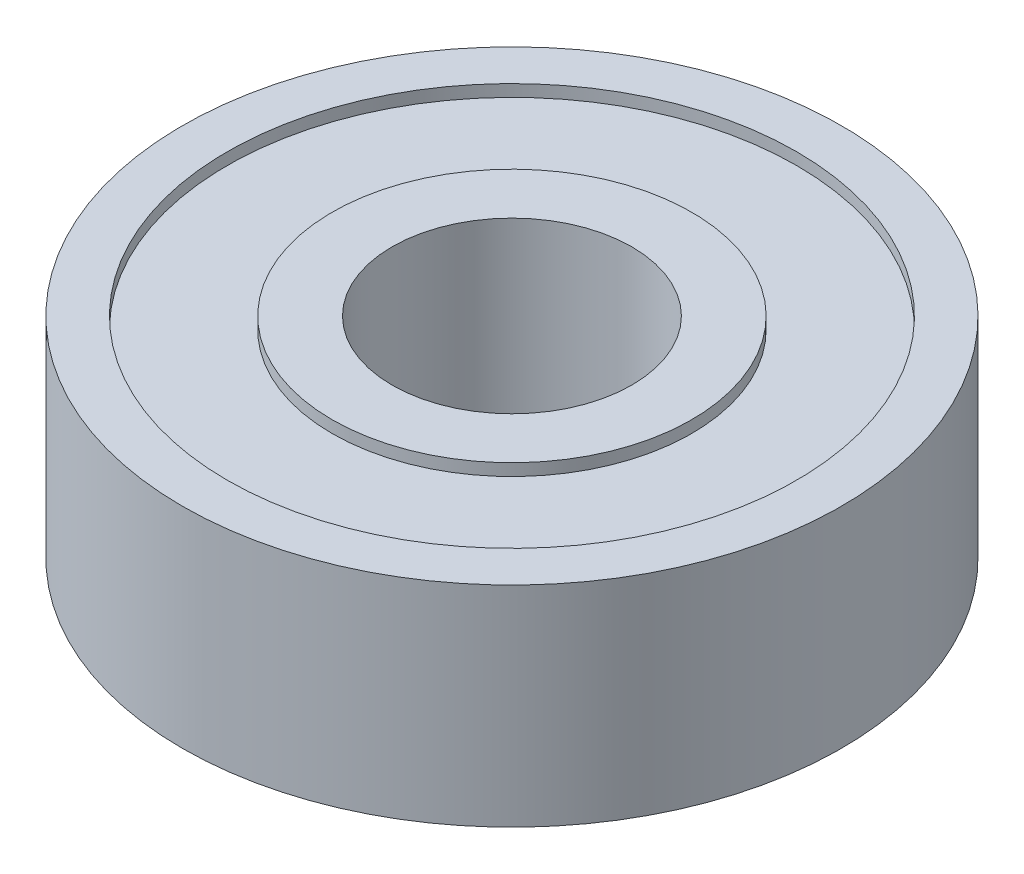
ISO-10303-21;
HEADER;
FILE_DESCRIPTION(('STEP AP214'),'2;1');
FILE_NAME('part.step','',(''),(''),'','','');
FILE_SCHEMA(('AUTOMOTIVE_DESIGN { 1 0 10303 214 1 1 1 1 }'));
ENDSEC;
DATA;
#1=APPLICATION_CONTEXT('core data for automotive mechanical design processes');
#2=APPLICATION_PROTOCOL_DEFINITION('international standard','automotive_design',2000,#1);
#3=PRODUCT_CONTEXT('',#1,'mechanical');
#4=PRODUCT('Part','Part','',(#3));
#5=PRODUCT_RELATED_PRODUCT_CATEGORY('part','',(#4));
#6=PRODUCT_DEFINITION_FORMATION('','',#4);
#7=PRODUCT_DEFINITION_CONTEXT('part definition',#1,'design');
#8=PRODUCT_DEFINITION('design','',#6,#7);
#9=PRODUCT_DEFINITION_SHAPE('','',#8);
#10=(LENGTH_UNIT() NAMED_UNIT(*) SI_UNIT(.MILLI.,.METRE.));
#11=(NAMED_UNIT(*) PLANE_ANGLE_UNIT() SI_UNIT($,.RADIAN.));
#12=(NAMED_UNIT(*) SI_UNIT($,.STERADIAN.) SOLID_ANGLE_UNIT());
#13=UNCERTAINTY_MEASURE_WITH_UNIT(LENGTH_MEASURE(1.E-05),#10,'distance_accuracy_value','');
#14=(GEOMETRIC_REPRESENTATION_CONTEXT(3) GLOBAL_UNCERTAINTY_ASSIGNED_CONTEXT((#13)) GLOBAL_UNIT_ASSIGNED_CONTEXT((#10,
#11,#12)) REPRESENTATION_CONTEXT('',''));
#15=CARTESIAN_POINT('',(0.,0.,0.));
#16=DIRECTION('',(0.,0.,1.));
#17=DIRECTION('',(1.,0.,0.));
#18=AXIS2_PLACEMENT_3D('',#15,#16,#17);
#19=CARTESIAN_POINT('',(0.,-3.5,0.));
#20=DIRECTION('',(0.,1.,0.));
#21=DIRECTION('',(0.,0.,1.));
#22=AXIS2_PLACEMENT_3D('',#19,#20,#21);
#23=PLANE('',#22);
#24=CARTESIAN_POINT('',(0.,-3.5,0.));
#25=DIRECTION('',(0.,1.,0.));
#26=DIRECTION('',(0.,0.,1.));
#27=AXIS2_PLACEMENT_3D('',#24,#25,#26);
#28=CIRCLE('',#27,4.);
#29=CARTESIAN_POINT('',(0.,-3.5,4.));
#30=VERTEX_POINT('',#29);
#31=EDGE_CURVE('E60',#30,#30,#28,.T.);
#32=ORIENTED_EDGE('',*,*,#31,.T.);
#33=EDGE_LOOP('',(#32));
#34=FACE_BOUND('',#33,.T.);
#35=CARTESIAN_POINT('',(0.,-3.5,0.));
#36=DIRECTION('',(0.,1.,0.));
#37=DIRECTION('',(0.,0.,1.));
#38=AXIS2_PLACEMENT_3D('',#35,#36,#37);
#39=CIRCLE('',#38,6.);
#40=CARTESIAN_POINT('',(0.,-3.5,6.));
#41=VERTEX_POINT('',#40);
#42=EDGE_CURVE('E44',#41,#41,#39,.T.);
#43=ORIENTED_EDGE('',*,*,#42,.F.);
#44=EDGE_LOOP('',(#43));
#45=FACE_BOUND('',#44,.T.);
#46=ADVANCED_FACE('F33',(#34,#45),#23,.F.);
#47=CARTESIAN_POINT('',(0.,-3.1,0.));
#48=DIRECTION('',(0.,-1.,0.));
#49=DIRECTION('',(0.,0.,1.));
#50=AXIS2_PLACEMENT_3D('',#47,#48,#49);
#51=CYLINDRICAL_SURFACE('',#50,9.5);
#52=CARTESIAN_POINT('',(0.,-3.1,0.));
#53=DIRECTION('',(0.,1.,0.));
#54=DIRECTION('',(0.,0.,1.));
#55=AXIS2_PLACEMENT_3D('',#52,#53,#54);
#56=CIRCLE('',#55,9.5);
#57=CARTESIAN_POINT('',(0.,-3.1,9.5));
#58=VERTEX_POINT('',#57);
#59=EDGE_CURVE('E40',#58,#58,#56,.T.);
#60=ORIENTED_EDGE('',*,*,#59,.T.);
#61=EDGE_LOOP('',(#60));
#62=FACE_BOUND('',#61,.T.);
#63=CARTESIAN_POINT('',(0.,-3.5,0.));
#64=DIRECTION('',(0.,1.,0.));
#65=DIRECTION('',(0.,0.,1.));
#66=AXIS2_PLACEMENT_3D('',#63,#64,#65);
#67=CIRCLE('',#66,9.5);
#68=CARTESIAN_POINT('',(0.,-3.5,9.5));
#69=VERTEX_POINT('',#68);
#70=EDGE_CURVE('E10',#69,#69,#67,.T.);
#71=ORIENTED_EDGE('',*,*,#70,.F.);
#72=EDGE_LOOP('',(#71));
#73=FACE_BOUND('',#72,.T.);
#74=ADVANCED_FACE('F35',(#62,#73),#51,.F.);
#75=CARTESIAN_POINT('',(0.,-3.1,0.));
#76=DIRECTION('',(0.,-1.,0.));
#77=DIRECTION('',(0.,0.,1.));
#78=AXIS2_PLACEMENT_3D('',#75,#76,#77);
#79=PLANE('',#78);
#80=CARTESIAN_POINT('',(0.,-3.1,0.));
#81=DIRECTION('',(0.,1.,0.));
#82=DIRECTION('',(0.,0.,1.));
#83=AXIS2_PLACEMENT_3D('',#80,#81,#82);
#84=CIRCLE('',#83,6.);
#85=CARTESIAN_POINT('',(0.,-3.1,6.));
#86=VERTEX_POINT('',#85);
#87=EDGE_CURVE('E48',#86,#86,#84,.T.);
#88=ORIENTED_EDGE('',*,*,#87,.T.);
#89=EDGE_LOOP('',(#88));
#90=FACE_BOUND('',#89,.T.);
#91=ORIENTED_EDGE('',*,*,#59,.F.);
#92=EDGE_LOOP('',(#91));
#93=FACE_BOUND('',#92,.T.);
#94=ADVANCED_FACE('F117',(#90,#93),#79,.T.);
#95=CARTESIAN_POINT('',(0.,-3.1,0.));
#96=DIRECTION('',(0.,-1.,0.));
#97=DIRECTION('',(0.,0.,1.));
#98=AXIS2_PLACEMENT_3D('',#95,#96,#97);
#99=CYLINDRICAL_SURFACE('',#98,6.);
#100=ORIENTED_EDGE('',*,*,#87,.F.);
#101=EDGE_LOOP('',(#100));
#102=FACE_BOUND('',#101,.T.);
#103=ORIENTED_EDGE('',*,*,#42,.T.);
#104=EDGE_LOOP('',(#103));
#105=FACE_BOUND('',#104,.T.);
#106=ADVANCED_FACE('F122',(#102,#105),#99,.T.);
#107=CARTESIAN_POINT('',(0.,3.5,0.));
#108=DIRECTION('',(0.,1.,0.));
#109=DIRECTION('',(0.,0.,1.));
#110=AXIS2_PLACEMENT_3D('',#107,#108,#109);
#111=PLANE('',#110);
#112=CARTESIAN_POINT('',(0.,3.5,0.));
#113=DIRECTION('',(0.,1.,0.));
#114=DIRECTION('',(0.,0.,1.));
#115=AXIS2_PLACEMENT_3D('',#112,#113,#114);
#116=CIRCLE('',#115,4.);
#117=CARTESIAN_POINT('',(0.,3.5,4.));
#118=VERTEX_POINT('',#117);
#119=EDGE_CURVE('E57',#118,#118,#116,.T.);
#120=ORIENTED_EDGE('',*,*,#119,.F.);
#121=EDGE_LOOP('',(#120));
#122=FACE_BOUND('',#121,.T.);
#123=CARTESIAN_POINT('',(0.,3.5,0.));
#124=DIRECTION('',(0.,1.,0.));
#125=DIRECTION('',(0.,0.,1.));
#126=AXIS2_PLACEMENT_3D('',#123,#124,#125);
#127=CIRCLE('',#126,6.);
#128=CARTESIAN_POINT('',(0.,3.5,6.));
#129=VERTEX_POINT('',#128);
#130=EDGE_CURVE('E72',#129,#129,#127,.T.);
#131=ORIENTED_EDGE('',*,*,#130,.T.);
#132=EDGE_LOOP('',(#131));
#133=FACE_BOUND('',#132,.T.);
#134=ADVANCED_FACE('F98',(#122,#133),#111,.T.);
#135=CARTESIAN_POINT('',(0.,3.5,0.));
#136=DIRECTION('',(0.,1.,0.));
#137=DIRECTION('',(0.,0.,1.));
#138=AXIS2_PLACEMENT_3D('',#135,#136,#137);
#139=CIRCLE('',#138,9.5);
#140=CARTESIAN_POINT('',(0.,3.5,9.5));
#141=VERTEX_POINT('',#140);
#142=EDGE_CURVE('E66',#141,#141,#139,.T.);
#143=ORIENTED_EDGE('',*,*,#142,.F.);
#144=EDGE_LOOP('',(#143));
#145=FACE_BOUND('',#144,.T.);
#146=CARTESIAN_POINT('',(0.,3.5,0.));
#147=DIRECTION('',(0.,1.,0.));
#148=DIRECTION('',(0.,0.,1.));
#149=AXIS2_PLACEMENT_3D('',#146,#147,#148);
#150=CIRCLE('',#149,11.);
#151=CARTESIAN_POINT('',(0.,3.5,11.));
#152=VERTEX_POINT('',#151);
#153=EDGE_CURVE('E53',#152,#152,#150,.T.);
#154=ORIENTED_EDGE('',*,*,#153,.T.);
#155=EDGE_LOOP('',(#154));
#156=FACE_BOUND('',#155,.T.);
#157=ADVANCED_FACE('F94',(#145,#156),#111,.T.);
#158=ORIENTED_EDGE('',*,*,#70,.T.);
#159=EDGE_LOOP('',(#158));
#160=FACE_BOUND('',#159,.T.);
#161=CARTESIAN_POINT('',(0.,-3.5,0.));
#162=DIRECTION('',(0.,1.,0.));
#163=DIRECTION('',(0.,0.,1.));
#164=AXIS2_PLACEMENT_3D('',#161,#162,#163);
#165=CIRCLE('',#164,11.);
#166=CARTESIAN_POINT('',(0.,-3.5,11.));
#167=VERTEX_POINT('',#166);
#168=EDGE_CURVE('E54',#167,#167,#165,.T.);
#169=ORIENTED_EDGE('',*,*,#168,.F.);
#170=EDGE_LOOP('',(#169));
#171=FACE_BOUND('',#170,.T.);
#172=ADVANCED_FACE('F97',(#160,#171),#23,.F.);
#173=CARTESIAN_POINT('',(0.,3.5,0.));
#174=DIRECTION('',(0.,-1.,0.));
#175=DIRECTION('',(0.,0.,-1.));
#176=AXIS2_PLACEMENT_3D('',#173,#174,#175);
#177=CYLINDRICAL_SURFACE('',#176,11.);
#178=ORIENTED_EDGE('',*,*,#153,.F.);
#179=EDGE_LOOP('',(#178));
#180=FACE_BOUND('',#179,.T.);
#181=ORIENTED_EDGE('',*,*,#168,.T.);
#182=EDGE_LOOP('',(#181));
#183=FACE_BOUND('',#182,.T.);
#184=ADVANCED_FACE('F102',(#180,#183),#177,.T.);
#185=CARTESIAN_POINT('',(0.,3.5,0.));
#186=DIRECTION('',(0.,-1.,0.));
#187=DIRECTION('',(0.,0.,-1.));
#188=AXIS2_PLACEMENT_3D('',#185,#186,#187);
#189=CYLINDRICAL_SURFACE('',#188,4.);
#190=ORIENTED_EDGE('',*,*,#119,.T.);
#191=EDGE_LOOP('',(#190));
#192=FACE_BOUND('',#191,.T.);
#193=ORIENTED_EDGE('',*,*,#31,.F.);
#194=EDGE_LOOP('',(#193));
#195=FACE_BOUND('',#194,.T.);
#196=ADVANCED_FACE('F90',(#192,#195),#189,.F.);
#197=CARTESIAN_POINT('',(0.,3.1,0.));
#198=DIRECTION('',(0.,1.,0.));
#199=DIRECTION('',(0.,0.,1.));
#200=AXIS2_PLACEMENT_3D('',#197,#198,#199);
#201=CYLINDRICAL_SURFACE('',#200,9.5);
#202=CARTESIAN_POINT('',(0.,3.1,0.));
#203=DIRECTION('',(0.,1.,0.));
#204=DIRECTION('',(0.,0.,1.));
#205=AXIS2_PLACEMENT_3D('',#202,#203,#204);
#206=CIRCLE('',#205,9.5);
#207=CARTESIAN_POINT('',(0.,3.1,9.5));
#208=VERTEX_POINT('',#207);
#209=EDGE_CURVE('E63',#208,#208,#206,.T.);
#210=ORIENTED_EDGE('',*,*,#209,.F.);
#211=EDGE_LOOP('',(#210));
#212=FACE_BOUND('',#211,.T.);
#213=ORIENTED_EDGE('',*,*,#142,.T.);
#214=EDGE_LOOP('',(#213));
#215=FACE_BOUND('',#214,.T.);
#216=ADVANCED_FACE('F84',(#212,#215),#201,.F.);
#217=CARTESIAN_POINT('',(0.,3.1,0.));
#218=DIRECTION('',(0.,1.,0.));
#219=DIRECTION('',(0.,0.,1.));
#220=AXIS2_PLACEMENT_3D('',#217,#218,#219);
#221=PLANE('',#220);
#222=CARTESIAN_POINT('',(0.,3.1,0.));
#223=DIRECTION('',(0.,1.,0.));
#224=DIRECTION('',(0.,0.,1.));
#225=AXIS2_PLACEMENT_3D('',#222,#223,#224);
#226=CIRCLE('',#225,6.);
#227=CARTESIAN_POINT('',(0.,3.1,6.));
#228=VERTEX_POINT('',#227);
#229=EDGE_CURVE('E69',#228,#228,#226,.T.);
#230=ORIENTED_EDGE('',*,*,#229,.F.);
#231=EDGE_LOOP('',(#230));
#232=FACE_BOUND('',#231,.T.);
#233=ORIENTED_EDGE('',*,*,#209,.T.);
#234=EDGE_LOOP('',(#233));
#235=FACE_BOUND('',#234,.T.);
#236=ADVANCED_FACE('F81',(#232,#235),#221,.T.);
#237=CARTESIAN_POINT('',(0.,3.1,0.));
#238=DIRECTION('',(0.,1.,0.));
#239=DIRECTION('',(0.,0.,1.));
#240=AXIS2_PLACEMENT_3D('',#237,#238,#239);
#241=CYLINDRICAL_SURFACE('',#240,6.);
#242=ORIENTED_EDGE('',*,*,#229,.T.);
#243=EDGE_LOOP('',(#242));
#244=FACE_BOUND('',#243,.T.);
#245=ORIENTED_EDGE('',*,*,#130,.F.);
#246=EDGE_LOOP('',(#245));
#247=FACE_BOUND('',#246,.T.);
#248=ADVANCED_FACE('F78',(#244,#247),#241,.T.);
#249=CLOSED_SHELL('',(#46,#74,#94,#106,#134,#157,#172,#184,#196,#216,#236,#248));
#250=MANIFOLD_SOLID_BREP('B2',#249);
#251=ADVANCED_BREP_SHAPE_REPRESENTATION('',(#18,#250),#14);
#252=SHAPE_DEFINITION_REPRESENTATION(#9,#251);
ENDSEC;
END-ISO-10303-21;
